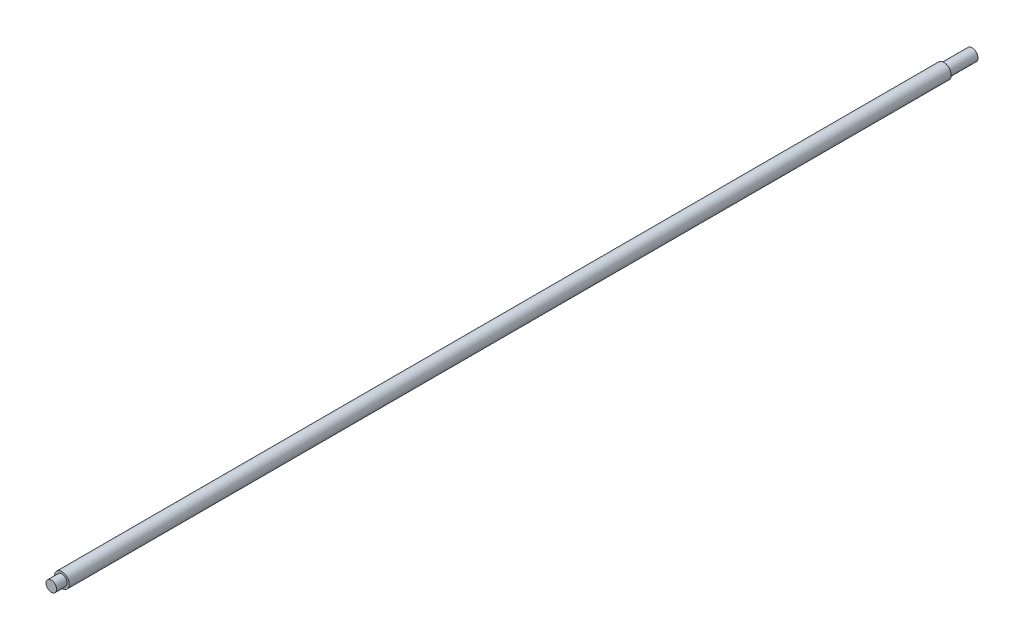
ISO-10303-21;
HEADER;
FILE_DESCRIPTION(('STEP AP214'),'2;1');
FILE_NAME('part.step','',(''),(''),'','','');
FILE_SCHEMA(('AUTOMOTIVE_DESIGN { 1 0 10303 214 1 1 1 1 }'));
ENDSEC;
DATA;
#1=APPLICATION_CONTEXT('core data for automotive mechanical design processes');
#2=APPLICATION_PROTOCOL_DEFINITION('international standard','automotive_design',2000,#1);
#3=PRODUCT_CONTEXT('',#1,'mechanical');
#4=PRODUCT('Part','Part','',(#3));
#5=PRODUCT_RELATED_PRODUCT_CATEGORY('part','',(#4));
#6=PRODUCT_DEFINITION_FORMATION('','',#4);
#7=PRODUCT_DEFINITION_CONTEXT('part definition',#1,'design');
#8=PRODUCT_DEFINITION('design','',#6,#7);
#9=PRODUCT_DEFINITION_SHAPE('','',#8);
#10=(LENGTH_UNIT() NAMED_UNIT(*) SI_UNIT(.MILLI.,.METRE.));
#11=(NAMED_UNIT(*) PLANE_ANGLE_UNIT() SI_UNIT($,.RADIAN.));
#12=(NAMED_UNIT(*) SI_UNIT($,.STERADIAN.) SOLID_ANGLE_UNIT());
#13=UNCERTAINTY_MEASURE_WITH_UNIT(LENGTH_MEASURE(1.E-05),#10,'distance_accuracy_value','');
#14=(GEOMETRIC_REPRESENTATION_CONTEXT(3) GLOBAL_UNCERTAINTY_ASSIGNED_CONTEXT((#13)) GLOBAL_UNIT_ASSIGNED_CONTEXT((#10,
#11,#12)) REPRESENTATION_CONTEXT('',''));
#15=CARTESIAN_POINT('',(0.,0.,0.));
#16=DIRECTION('',(0.,0.,1.));
#17=DIRECTION('',(1.,0.,0.));
#18=AXIS2_PLACEMENT_3D('',#15,#16,#17);
#19=CARTESIAN_POINT('',(0.,0.,1497.));
#20=DIRECTION('',(0.,0.,-1.));
#21=DIRECTION('',(-1.,0.,0.));
#22=AXIS2_PLACEMENT_3D('',#19,#20,#21);
#23=CYLINDRICAL_SURFACE('',#22,12.5);
#24=CARTESIAN_POINT('',(0.,0.,1497.));
#25=DIRECTION('',(0.,0.,1.));
#26=DIRECTION('',(1.,0.,0.));
#27=AXIS2_PLACEMENT_3D('',#24,#25,#26);
#28=CIRCLE('',#27,12.5);
#29=CARTESIAN_POINT('',(12.5,0.,1497.));
#30=VERTEX_POINT('',#29);
#31=EDGE_CURVE('E44',#30,#30,#28,.T.);
#32=ORIENTED_EDGE('',*,*,#31,.F.);
#33=EDGE_LOOP('',(#32));
#34=FACE_BOUND('',#33,.T.);
#35=CARTESIAN_POINT('',(0.,0.,0.));
#36=DIRECTION('',(0.,0.,1.));
#37=DIRECTION('',(1.,0.,0.));
#38=AXIS2_PLACEMENT_3D('',#35,#36,#37);
#39=CIRCLE('',#38,12.5);
#40=CARTESIAN_POINT('',(12.5,0.,0.));
#41=VERTEX_POINT('',#40);
#42=EDGE_CURVE('E35',#41,#41,#39,.T.);
#43=ORIENTED_EDGE('',*,*,#42,.T.);
#44=EDGE_LOOP('',(#43));
#45=FACE_BOUND('',#44,.T.);
#46=ADVANCED_FACE('F32',(#34,#45),#23,.T.);
#47=CARTESIAN_POINT('',(0.,0.,1497.));
#48=DIRECTION('',(0.,0.,1.));
#49=DIRECTION('',(1.,0.,0.));
#50=AXIS2_PLACEMENT_3D('',#47,#48,#49);
#51=PLANE('',#50);
#52=CARTESIAN_POINT('',(0.,0.,1497.));
#53=DIRECTION('',(0.,0.,1.));
#54=DIRECTION('',(1.,0.,0.));
#55=AXIS2_PLACEMENT_3D('',#52,#53,#54);
#56=CIRCLE('',#55,9.);
#57=CARTESIAN_POINT('',(9.,0.,1497.));
#58=VERTEX_POINT('',#57);
#59=EDGE_CURVE('E39',#58,#58,#56,.T.);
#60=ORIENTED_EDGE('',*,*,#59,.F.);
#61=EDGE_LOOP('',(#60));
#62=FACE_BOUND('',#61,.T.);
#63=ORIENTED_EDGE('',*,*,#31,.T.);
#64=EDGE_LOOP('',(#63));
#65=FACE_BOUND('',#64,.T.);
#66=ADVANCED_FACE('F61',(#62,#65),#51,.T.);
#67=CARTESIAN_POINT('',(0.,0.,0.));
#68=DIRECTION('',(0.,0.,1.));
#69=DIRECTION('',(1.,0.,0.));
#70=AXIS2_PLACEMENT_3D('',#67,#68,#69);
#71=PLANE('',#70);
#72=CARTESIAN_POINT('',(0.,0.,0.));
#73=DIRECTION('',(0.,0.,-1.));
#74=DIRECTION('',(-1.,0.,0.));
#75=AXIS2_PLACEMENT_3D('',#72,#73,#74);
#76=CIRCLE('',#75,10.);
#77=CARTESIAN_POINT('',(-10.,0.,0.));
#78=VERTEX_POINT('',#77);
#79=EDGE_CURVE('E10',#78,#78,#76,.T.);
#80=ORIENTED_EDGE('',*,*,#79,.F.);
#81=EDGE_LOOP('',(#80));
#82=FACE_BOUND('',#81,.T.);
#83=ORIENTED_EDGE('',*,*,#42,.F.);
#84=EDGE_LOOP('',(#83));
#85=FACE_BOUND('',#84,.T.);
#86=ADVANCED_FACE('F58',(#82,#85),#71,.F.);
#87=CARTESIAN_POINT('',(0.,0.,1515.));
#88=DIRECTION('',(0.,0.,-1.));
#89=DIRECTION('',(-1.,0.,0.));
#90=AXIS2_PLACEMENT_3D('',#87,#88,#89);
#91=CYLINDRICAL_SURFACE('',#90,9.);
#92=CARTESIAN_POINT('',(0.,0.,1515.));
#93=DIRECTION('',(0.,0.,1.));
#94=DIRECTION('',(1.,0.,0.));
#95=AXIS2_PLACEMENT_3D('',#92,#93,#94);
#96=CIRCLE('',#95,9.);
#97=CARTESIAN_POINT('',(9.,0.,1515.));
#98=VERTEX_POINT('',#97);
#99=EDGE_CURVE('E49',#98,#98,#96,.T.);
#100=ORIENTED_EDGE('',*,*,#99,.F.);
#101=EDGE_LOOP('',(#100));
#102=FACE_BOUND('',#101,.T.);
#103=ORIENTED_EDGE('',*,*,#59,.T.);
#104=EDGE_LOOP('',(#103));
#105=FACE_BOUND('',#104,.T.);
#106=ADVANCED_FACE('F60',(#102,#105),#91,.T.);
#107=CARTESIAN_POINT('',(0.,0.,1515.));
#108=DIRECTION('',(0.,0.,1.));
#109=DIRECTION('',(1.,0.,0.));
#110=AXIS2_PLACEMENT_3D('',#107,#108,#109);
#111=PLANE('',#110);
#112=ORIENTED_EDGE('',*,*,#99,.T.);
#113=EDGE_LOOP('',(#112));
#114=FACE_BOUND('',#113,.T.);
#115=ADVANCED_FACE('F67',(#114),#111,.T.);
#116=CARTESIAN_POINT('',(0.,0.,-48.));
#117=DIRECTION('',(0.,0.,1.));
#118=DIRECTION('',(1.,0.,0.));
#119=AXIS2_PLACEMENT_3D('',#116,#117,#118);
#120=CYLINDRICAL_SURFACE('',#119,10.);
#121=CARTESIAN_POINT('',(0.,0.,-48.));
#122=DIRECTION('',(0.,0.,-1.));
#123=DIRECTION('',(-1.,0.,0.));
#124=AXIS2_PLACEMENT_3D('',#121,#122,#123);
#125=CIRCLE('',#124,10.);
#126=CARTESIAN_POINT('',(-10.,0.,-48.));
#127=VERTEX_POINT('',#126);
#128=EDGE_CURVE('E48',#127,#127,#125,.T.);
#129=ORIENTED_EDGE('',*,*,#128,.F.);
#130=EDGE_LOOP('',(#129));
#131=FACE_BOUND('',#130,.T.);
#132=ORIENTED_EDGE('',*,*,#79,.T.);
#133=EDGE_LOOP('',(#132));
#134=FACE_BOUND('',#133,.T.);
#135=ADVANCED_FACE('F95',(#131,#134),#120,.T.);
#136=CARTESIAN_POINT('',(0.,0.,-48.));
#137=DIRECTION('',(0.,0.,-1.));
#138=DIRECTION('',(-1.,0.,0.));
#139=AXIS2_PLACEMENT_3D('',#136,#137,#138);
#140=PLANE('',#139);
#141=ORIENTED_EDGE('',*,*,#128,.T.);
#142=EDGE_LOOP('',(#141));
#143=FACE_BOUND('',#142,.T.);
#144=ADVANCED_FACE('F109',(#143),#140,.T.);
#145=CLOSED_SHELL('',(#46,#66,#86,#106,#115,#135,#144));
#146=MANIFOLD_SOLID_BREP('B2',#145);
#147=ADVANCED_BREP_SHAPE_REPRESENTATION('',(#18,#146),#14);
#148=SHAPE_DEFINITION_REPRESENTATION(#9,#147);
ENDSEC;
END-ISO-10303-21;
